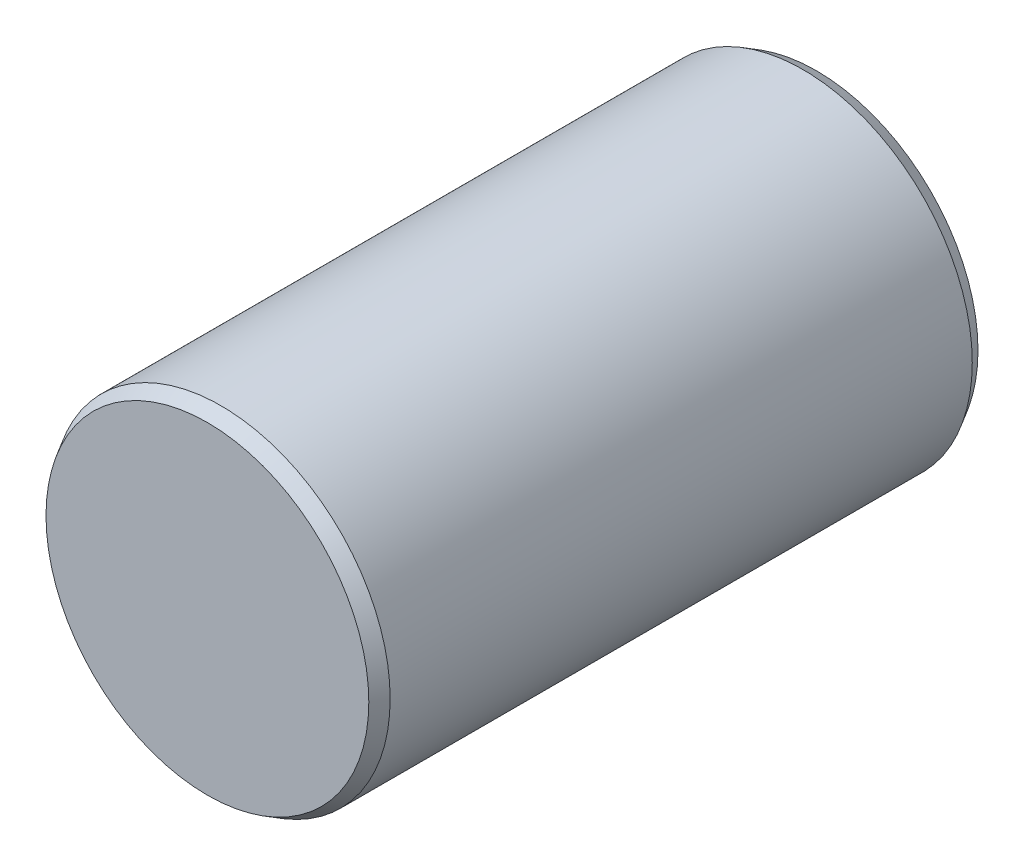
ISO-10303-21;
HEADER;
FILE_DESCRIPTION(('STEP AP214'),'2;1');
FILE_NAME('part.step','',(''),(''),'','','');
FILE_SCHEMA(('AUTOMOTIVE_DESIGN { 1 0 10303 214 1 1 1 1 }'));
ENDSEC;
DATA;
#1=APPLICATION_CONTEXT('core data for automotive mechanical design processes');
#2=APPLICATION_PROTOCOL_DEFINITION('international standard','automotive_design',2000,#1);
#3=PRODUCT_CONTEXT('',#1,'mechanical');
#4=PRODUCT('Part','Part','',(#3));
#5=PRODUCT_RELATED_PRODUCT_CATEGORY('part','',(#4));
#6=PRODUCT_DEFINITION_FORMATION('','',#4);
#7=PRODUCT_DEFINITION_CONTEXT('part definition',#1,'design');
#8=PRODUCT_DEFINITION('design','',#6,#7);
#9=PRODUCT_DEFINITION_SHAPE('','',#8);
#10=(LENGTH_UNIT() NAMED_UNIT(*) SI_UNIT(.MILLI.,.METRE.));
#11=(NAMED_UNIT(*) PLANE_ANGLE_UNIT() SI_UNIT($,.RADIAN.));
#12=(NAMED_UNIT(*) SI_UNIT($,.STERADIAN.) SOLID_ANGLE_UNIT());
#13=UNCERTAINTY_MEASURE_WITH_UNIT(LENGTH_MEASURE(1.E-05),#10,'distance_accuracy_value','');
#14=(GEOMETRIC_REPRESENTATION_CONTEXT(3) GLOBAL_UNCERTAINTY_ASSIGNED_CONTEXT((#13)) GLOBAL_UNIT_ASSIGNED_CONTEXT((#10,
#11,#12)) REPRESENTATION_CONTEXT('',''));
#15=CARTESIAN_POINT('',(0.,0.,0.));
#16=DIRECTION('',(0.,0.,1.));
#17=DIRECTION('',(1.,0.,0.));
#18=AXIS2_PLACEMENT_3D('',#15,#16,#17);
#19=CARTESIAN_POINT('',(0.,0.,4.5));
#20=DIRECTION('',(0.,0.,-1.));
#21=DIRECTION('',(-1.,0.,0.));
#22=AXIS2_PLACEMENT_3D('',#19,#20,#21);
#23=CYLINDRICAL_SURFACE('',#22,2.5);
#24=CARTESIAN_POINT('',(0.,0.,-4.3));
#25=DIRECTION('',(0.,0.,1.));
#26=DIRECTION('',(1.,0.,0.));
#27=AXIS2_PLACEMENT_3D('',#24,#25,#26);
#28=CIRCLE('',#27,2.5);
#29=CARTESIAN_POINT('',(2.5,0.,-4.3));
#30=VERTEX_POINT('',#29);
#31=EDGE_CURVE('E42',#30,#30,#28,.T.);
#32=ORIENTED_EDGE('',*,*,#31,.T.);
#33=EDGE_LOOP('',(#32));
#34=FACE_BOUND('',#33,.T.);
#35=CARTESIAN_POINT('',(0.,0.,4.3));
#36=DIRECTION('',(0.,0.,1.));
#37=DIRECTION('',(1.,0.,0.));
#38=AXIS2_PLACEMENT_3D('',#35,#36,#37);
#39=CIRCLE('',#38,2.5);
#40=CARTESIAN_POINT('',(2.5,0.,4.3));
#41=VERTEX_POINT('',#40);
#42=EDGE_CURVE('E46',#41,#41,#39,.F.);
#43=ORIENTED_EDGE('',*,*,#42,.T.);
#44=EDGE_LOOP('',(#43));
#45=FACE_BOUND('',#44,.T.);
#46=ADVANCED_FACE('F31',(#34,#45),#23,.T.);
#47=CARTESIAN_POINT('',(0.,0.,4.5));
#48=DIRECTION('',(0.,0.,1.));
#49=DIRECTION('',(1.,0.,0.));
#50=AXIS2_PLACEMENT_3D('',#47,#48,#49);
#51=PLANE('',#50);
#52=CARTESIAN_POINT('',(0.,0.,4.5));
#53=DIRECTION('',(0.,0.,1.));
#54=DIRECTION('',(1.,0.,0.));
#55=AXIS2_PLACEMENT_3D('',#52,#53,#54);
#56=CIRCLE('',#55,2.38452994616208);
#57=CARTESIAN_POINT('',(2.38452994616208,0.,4.5));
#58=VERTEX_POINT('',#57);
#59=EDGE_CURVE('E10',#58,#58,#56,.T.);
#60=ORIENTED_EDGE('',*,*,#59,.T.);
#61=EDGE_LOOP('',(#60));
#62=FACE_BOUND('',#61,.T.);
#63=ADVANCED_FACE('F62',(#62),#51,.T.);
#64=CARTESIAN_POINT('',(0.,0.,-4.5));
#65=DIRECTION('',(0.,0.,1.));
#66=DIRECTION('',(1.,0.,0.));
#67=AXIS2_PLACEMENT_3D('',#64,#65,#66);
#68=PLANE('',#67);
#69=CARTESIAN_POINT('',(0.,0.,-4.5));
#70=DIRECTION('',(0.,0.,1.));
#71=DIRECTION('',(1.,0.,0.));
#72=AXIS2_PLACEMENT_3D('',#69,#70,#71);
#73=CIRCLE('',#72,2.38452994616208);
#74=CARTESIAN_POINT('',(2.38452994616208,0.,-4.5));
#75=VERTEX_POINT('',#74);
#76=EDGE_CURVE('E38',#75,#75,#73,.F.);
#77=ORIENTED_EDGE('',*,*,#76,.T.);
#78=EDGE_LOOP('',(#77));
#79=FACE_BOUND('',#78,.T.);
#80=ADVANCED_FACE('F59',(#79),#68,.F.);
#81=CARTESIAN_POINT('',(0.,0.,-4.3));
#82=DIRECTION('',(0.,0.,1.));
#83=DIRECTION('',(1.,0.,0.));
#84=AXIS2_PLACEMENT_3D('',#81,#82,#83);
#85=CONICAL_SURFACE('',#84,2.5,0.523598775598296);
#86=ORIENTED_EDGE('',*,*,#76,.F.);
#87=EDGE_LOOP('',(#86));
#88=FACE_BOUND('',#87,.T.);
#89=ORIENTED_EDGE('',*,*,#31,.F.);
#90=EDGE_LOOP('',(#89));
#91=FACE_BOUND('',#90,.T.);
#92=ADVANCED_FACE('F55',(#88,#91),#85,.T.);
#93=CARTESIAN_POINT('',(0.,0.,4.5));
#94=DIRECTION('',(0.,0.,-1.));
#95=DIRECTION('',(-1.,0.,0.));
#96=AXIS2_PLACEMENT_3D('',#93,#94,#95);
#97=CONICAL_SURFACE('',#96,2.38452994616208,0.523598775598295);
#98=ORIENTED_EDGE('',*,*,#42,.F.);
#99=EDGE_LOOP('',(#98));
#100=FACE_BOUND('',#99,.T.);
#101=ORIENTED_EDGE('',*,*,#59,.F.);
#102=EDGE_LOOP('',(#101));
#103=FACE_BOUND('',#102,.T.);
#104=ADVANCED_FACE('F33',(#100,#103),#97,.T.);
#105=CLOSED_SHELL('',(#46,#63,#80,#92,#104));
#106=MANIFOLD_SOLID_BREP('B2',#105);
#107=ADVANCED_BREP_SHAPE_REPRESENTATION('',(#18,#106),#14);
#108=SHAPE_DEFINITION_REPRESENTATION(#9,#107);
ENDSEC;
END-ISO-10303-21;
